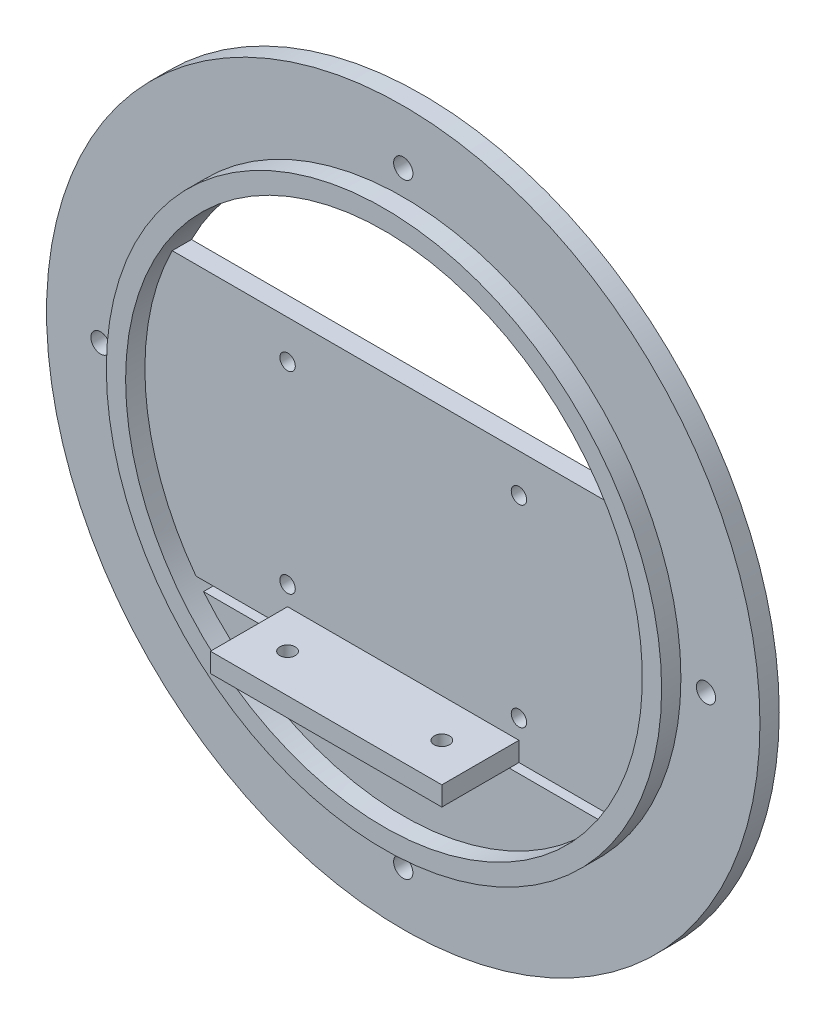
ISO-10303-21;
HEADER;
FILE_DESCRIPTION(('STEP AP214'),'2;1');
FILE_NAME('part.step','',(''),(''),'','','');
FILE_SCHEMA(('AUTOMOTIVE_DESIGN { 1 0 10303 214 1 1 1 1 }'));
ENDSEC;
DATA;
#1=APPLICATION_CONTEXT('core data for automotive mechanical design processes');
#2=APPLICATION_PROTOCOL_DEFINITION('international standard','automotive_design',2000,#1);
#3=PRODUCT_CONTEXT('',#1,'mechanical');
#4=PRODUCT('Part','Part','',(#3));
#5=PRODUCT_RELATED_PRODUCT_CATEGORY('part','',(#4));
#6=PRODUCT_DEFINITION_FORMATION('','',#4);
#7=PRODUCT_DEFINITION_CONTEXT('part definition',#1,'design');
#8=PRODUCT_DEFINITION('design','',#6,#7);
#9=PRODUCT_DEFINITION_SHAPE('','',#8);
#10=(LENGTH_UNIT() NAMED_UNIT(*) SI_UNIT(.MILLI.,.METRE.));
#11=(NAMED_UNIT(*) PLANE_ANGLE_UNIT() SI_UNIT($,.RADIAN.));
#12=(NAMED_UNIT(*) SI_UNIT($,.STERADIAN.) SOLID_ANGLE_UNIT());
#13=UNCERTAINTY_MEASURE_WITH_UNIT(LENGTH_MEASURE(1.E-05),#10,'distance_accuracy_value','');
#14=(GEOMETRIC_REPRESENTATION_CONTEXT(3) GLOBAL_UNCERTAINTY_ASSIGNED_CONTEXT((#13)) GLOBAL_UNIT_ASSIGNED_CONTEXT((#10,
#11,#12)) REPRESENTATION_CONTEXT('',''));
#15=CARTESIAN_POINT('',(0.,0.,0.));
#16=DIRECTION('',(0.,0.,1.));
#17=DIRECTION('',(1.,0.,0.));
#18=AXIS2_PLACEMENT_3D('',#15,#16,#17);
#19=CARTESIAN_POINT('',(0.,0.,0.));
#20=DIRECTION('',(0.,0.,1.));
#21=DIRECTION('',(1.,0.,0.));
#22=AXIS2_PLACEMENT_3D('',#19,#20,#21);
#23=PLANE('',#22);
#24=CARTESIAN_POINT('',(0.,-78.5,0.));
#25=DIRECTION('',(0.,0.,-1.));
#26=DIRECTION('',(-1.,0.,0.));
#27=AXIS2_PLACEMENT_3D('',#24,#25,#26);
#28=CIRCLE('',#27,2.5);
#29=CARTESIAN_POINT('',(-2.5,-78.5,0.));
#30=VERTEX_POINT('',#29);
#31=EDGE_CURVE('E373',#30,#30,#28,.T.);
#32=ORIENTED_EDGE('',*,*,#31,.F.);
#33=EDGE_LOOP('',(#32));
#34=FACE_BOUND('',#33,.T.);
#35=CARTESIAN_POINT('',(78.5,0.,0.));
#36=DIRECTION('',(0.,0.,-1.));
#37=DIRECTION('',(-1.,0.,0.));
#38=AXIS2_PLACEMENT_3D('',#35,#36,#37);
#39=CIRCLE('',#38,2.50000000000001);
#40=CARTESIAN_POINT('',(76.,0.,0.));
#41=VERTEX_POINT('',#40);
#42=EDGE_CURVE('E367',#41,#41,#39,.T.);
#43=ORIENTED_EDGE('',*,*,#42,.F.);
#44=EDGE_LOOP('',(#43));
#45=FACE_BOUND('',#44,.T.);
#46=CARTESIAN_POINT('',(0.,78.5,0.));
#47=DIRECTION('',(0.,0.,-1.));
#48=DIRECTION('',(-1.,0.,0.));
#49=AXIS2_PLACEMENT_3D('',#46,#47,#48);
#50=CIRCLE('',#49,2.5);
#51=CARTESIAN_POINT('',(-2.5,78.5,0.));
#52=VERTEX_POINT('',#51);
#53=EDGE_CURVE('E360',#52,#52,#50,.T.);
#54=ORIENTED_EDGE('',*,*,#53,.F.);
#55=EDGE_LOOP('',(#54));
#56=FACE_BOUND('',#55,.T.);
#57=CARTESIAN_POINT('',(-78.5,0.,0.));
#58=DIRECTION('',(0.,0.,-1.));
#59=DIRECTION('',(-1.,0.,0.));
#60=AXIS2_PLACEMENT_3D('',#57,#58,#59);
#61=CIRCLE('',#60,2.49999999999999);
#62=CARTESIAN_POINT('',(-81.,0.,0.));
#63=VERTEX_POINT('',#62);
#64=EDGE_CURVE('E361',#63,#63,#61,.T.);
#65=ORIENTED_EDGE('',*,*,#64,.F.);
#66=EDGE_LOOP('',(#65));
#67=FACE_BOUND('',#66,.T.);
#68=CARTESIAN_POINT('',(-30.,-30.,0.));
#69=DIRECTION('',(0.,0.,-1.));
#70=DIRECTION('',(-1.,0.,0.));
#71=AXIS2_PLACEMENT_3D('',#68,#69,#70);
#72=CIRCLE('',#71,2.);
#73=CARTESIAN_POINT('',(-32.,-30.,0.));
#74=VERTEX_POINT('',#73);
#75=EDGE_CURVE('E343',#74,#74,#72,.T.);
#76=ORIENTED_EDGE('',*,*,#75,.F.);
#77=EDGE_LOOP('',(#76));
#78=FACE_BOUND('',#77,.T.);
#79=CARTESIAN_POINT('',(-30.,20.,0.));
#80=DIRECTION('',(0.,0.,-1.));
#81=DIRECTION('',(-1.,0.,0.));
#82=AXIS2_PLACEMENT_3D('',#79,#80,#81);
#83=CIRCLE('',#82,2.);
#84=CARTESIAN_POINT('',(-32.,20.,0.));
#85=VERTEX_POINT('',#84);
#86=EDGE_CURVE('E342',#85,#85,#83,.T.);
#87=ORIENTED_EDGE('',*,*,#86,.F.);
#88=EDGE_LOOP('',(#87));
#89=FACE_BOUND('',#88,.T.);
#90=CARTESIAN_POINT('',(30.,20.,0.));
#91=DIRECTION('',(0.,0.,-1.));
#92=DIRECTION('',(-1.,0.,0.));
#93=AXIS2_PLACEMENT_3D('',#90,#91,#92);
#94=CIRCLE('',#93,2.);
#95=CARTESIAN_POINT('',(28.,20.,0.));
#96=VERTEX_POINT('',#95);
#97=EDGE_CURVE('E350',#96,#96,#94,.T.);
#98=ORIENTED_EDGE('',*,*,#97,.F.);
#99=EDGE_LOOP('',(#98));
#100=FACE_BOUND('',#99,.T.);
#101=CARTESIAN_POINT('',(30.,-30.,0.));
#102=DIRECTION('',(0.,0.,-1.));
#103=DIRECTION('',(-1.,0.,0.));
#104=AXIS2_PLACEMENT_3D('',#101,#102,#103);
#105=CIRCLE('',#104,2.);
#106=CARTESIAN_POINT('',(28.,-30.,0.));
#107=VERTEX_POINT('',#106);
#108=EDGE_CURVE('E335',#107,#107,#105,.T.);
#109=ORIENTED_EDGE('',*,*,#108,.F.);
#110=EDGE_LOOP('',(#109));
#111=FACE_BOUND('',#110,.T.);
#112=CARTESIAN_POINT('',(0.,0.,0.));
#113=DIRECTION('',(0.,0.,1.));
#114=DIRECTION('',(1.,0.,0.));
#115=AXIS2_PLACEMENT_3D('',#112,#113,#114);
#116=CIRCLE('',#115,92.5);
#117=CARTESIAN_POINT('',(92.5,0.,0.));
#118=VERTEX_POINT('',#117);
#119=EDGE_CURVE('E218',#118,#118,#116,.T.);
#120=ORIENTED_EDGE('',*,*,#119,.F.);
#121=EDGE_LOOP('',(#120));
#122=FACE_BOUND('',#121,.T.);
#123=DIRECTION('',(1.,0.,0.));
#124=VECTOR('',#123,1.);
#125=CARTESIAN_POINT('',(-70.,30.,0.));
#126=LINE('',#125,#124);
#127=CARTESIAN_POINT('',(-59.9082632030007,30.,0.));
#128=VERTEX_POINT('',#127);
#129=CARTESIAN_POINT('',(59.9082632030007,30.,0.));
#130=VERTEX_POINT('',#129);
#131=EDGE_CURVE('E198',#128,#130,#126,.T.);
#132=ORIENTED_EDGE('',*,*,#131,.T.);
#133=CARTESIAN_POINT('',(0.,0.,0.));
#134=DIRECTION('',(0.,0.,-1.));
#135=DIRECTION('',(-1.,0.,0.));
#136=AXIS2_PLACEMENT_3D('',#133,#134,#135);
#137=CIRCLE('',#136,67.);
#138=EDGE_CURVE('E213',#128,#130,#137,.T.);
#139=ORIENTED_EDGE('',*,*,#138,.F.);
#140=EDGE_LOOP('',(#132,#139));
#141=FACE_BOUND('',#140,.T.);
#142=DIRECTION('',(0.,-1.,0.));
#143=VECTOR('',#142,1.);
#144=CARTESIAN_POINT('',(30.,-42.5,0.));
#145=LINE('',#144,#143);
#146=CARTESIAN_POINT('',(30.,-42.5,0.));
#147=VERTEX_POINT('',#146);
#148=CARTESIAN_POINT('',(30.,-47.5,0.));
#149=VERTEX_POINT('',#148);
#150=EDGE_CURVE('E160',#147,#149,#145,.T.);
#151=ORIENTED_EDGE('',*,*,#150,.F.);
#152=DIRECTION('',(1.,0.,0.));
#153=VECTOR('',#152,1.);
#154=CARTESIAN_POINT('',(55.,-42.5,0.));
#155=LINE('',#154,#153);
#156=CARTESIAN_POINT('',(51.7952700543206,-42.5,0.));
#157=VERTEX_POINT('',#156);
#158=EDGE_CURVE('E161',#147,#157,#155,.T.);
#159=ORIENTED_EDGE('',*,*,#158,.T.);
#160=CARTESIAN_POINT('',(55.52251795443,-37.5,0.));
#161=VERTEX_POINT('',#160);
#162=EDGE_CURVE('E215',#161,#157,#137,.T.);
#163=ORIENTED_EDGE('',*,*,#162,.F.);
#164=DIRECTION('',(-1.,0.,0.));
#165=VECTOR('',#164,1.);
#166=CARTESIAN_POINT('',(-53.7494186015068,-37.5,0.));
#167=LINE('',#166,#165);
#168=CARTESIAN_POINT('',(-55.52251795443,-37.5,0.));
#169=VERTEX_POINT('',#168);
#170=EDGE_CURVE('E240',#161,#169,#167,.T.);
#171=ORIENTED_EDGE('',*,*,#170,.T.);
#172=CARTESIAN_POINT('',(-51.7952700543206,-42.5,0.));
#173=VERTEX_POINT('',#172);
#174=EDGE_CURVE('E206',#173,#169,#137,.T.);
#175=ORIENTED_EDGE('',*,*,#174,.F.);
#176=CARTESIAN_POINT('',(-30.,-42.5,0.));
#177=VERTEX_POINT('',#176);
#178=EDGE_CURVE('E163',#173,#177,#155,.T.);
#179=ORIENTED_EDGE('',*,*,#178,.T.);
#180=DIRECTION('',(0.,1.,0.));
#181=VECTOR('',#180,1.);
#182=CARTESIAN_POINT('',(-30.,-42.5,0.));
#183=LINE('',#182,#181);
#184=CARTESIAN_POINT('',(-30.,-47.5,0.));
#185=VERTEX_POINT('',#184);
#186=EDGE_CURVE('E54',#185,#177,#183,.T.);
#187=ORIENTED_EDGE('',*,*,#186,.F.);
#188=DIRECTION('',(-1.,0.,0.));
#189=VECTOR('',#188,1.);
#190=CARTESIAN_POINT('',(30.,-47.5,0.));
#191=LINE('',#190,#189);
#192=EDGE_CURVE('E49',#149,#185,#191,.T.);
#193=ORIENTED_EDGE('',*,*,#192,.F.);
#194=EDGE_LOOP('',(#151,#159,#163,#171,#175,#179,#187,#193));
#195=FACE_BOUND('',#194,.T.);
#196=ADVANCED_FACE('F33',(#34,#45,#56,#67,#78,#89,#100,#111,#122,#141,#195),#23,.F.);
#197=CARTESIAN_POINT('',(0.,0.,5.));
#198=DIRECTION('',(0.,0.,1.));
#199=DIRECTION('',(1.,0.,0.));
#200=AXIS2_PLACEMENT_3D('',#197,#198,#199);
#201=PLANE('',#200);
#202=CARTESIAN_POINT('',(-30.,-30.,5.));
#203=DIRECTION('',(0.,0.,1.));
#204=DIRECTION('',(1.,0.,0.));
#205=AXIS2_PLACEMENT_3D('',#202,#203,#204);
#206=CIRCLE('',#205,2.);
#207=CARTESIAN_POINT('',(-28.,-30.,5.));
#208=VERTEX_POINT('',#207);
#209=EDGE_CURVE('E339',#208,#208,#206,.F.);
#210=ORIENTED_EDGE('',*,*,#209,.T.);
#211=EDGE_LOOP('',(#210));
#212=FACE_BOUND('',#211,.T.);
#213=CARTESIAN_POINT('',(-30.,20.,5.));
#214=DIRECTION('',(0.,0.,1.));
#215=DIRECTION('',(1.,0.,0.));
#216=AXIS2_PLACEMENT_3D('',#213,#214,#215);
#217=CIRCLE('',#216,2.);
#218=CARTESIAN_POINT('',(-28.,20.,5.));
#219=VERTEX_POINT('',#218);
#220=EDGE_CURVE('E347',#219,#219,#217,.F.);
#221=ORIENTED_EDGE('',*,*,#220,.T.);
#222=EDGE_LOOP('',(#221));
#223=FACE_BOUND('',#222,.T.);
#224=CARTESIAN_POINT('',(30.,20.,5.));
#225=DIRECTION('',(0.,0.,1.));
#226=DIRECTION('',(1.,0.,0.));
#227=AXIS2_PLACEMENT_3D('',#224,#225,#226);
#228=CIRCLE('',#227,2.);
#229=CARTESIAN_POINT('',(32.,20.,5.));
#230=VERTEX_POINT('',#229);
#231=EDGE_CURVE('E338',#230,#230,#228,.F.);
#232=ORIENTED_EDGE('',*,*,#231,.T.);
#233=EDGE_LOOP('',(#232));
#234=FACE_BOUND('',#233,.T.);
#235=CARTESIAN_POINT('',(30.,-30.,5.));
#236=DIRECTION('',(0.,0.,1.));
#237=DIRECTION('',(1.,0.,0.));
#238=AXIS2_PLACEMENT_3D('',#235,#236,#237);
#239=CIRCLE('',#238,2.);
#240=CARTESIAN_POINT('',(32.,-30.,5.));
#241=VERTEX_POINT('',#240);
#242=EDGE_CURVE('E328',#241,#241,#239,.F.);
#243=ORIENTED_EDGE('',*,*,#242,.T.);
#244=EDGE_LOOP('',(#243));
#245=FACE_BOUND('',#244,.T.);
#246=DIRECTION('',(-1.,0.,0.));
#247=VECTOR('',#246,1.);
#248=CARTESIAN_POINT('',(30.,-35.,5.));
#249=LINE('',#248,#247);
#250=CARTESIAN_POINT('',(30.,-35.,5.));
#251=VERTEX_POINT('',#250);
#252=CARTESIAN_POINT('',(-30.,-35.,5.));
#253=VERTEX_POINT('',#252);
#254=EDGE_CURVE('E186',#251,#253,#249,.T.);
#255=ORIENTED_EDGE('',*,*,#254,.F.);
#256=DIRECTION('',(0.,1.,0.));
#257=VECTOR('',#256,1.);
#258=CARTESIAN_POINT('',(30.,-40.,5.));
#259=LINE('',#258,#257);
#260=CARTESIAN_POINT('',(30.,-40.,5.));
#261=VERTEX_POINT('',#260);
#262=EDGE_CURVE('E171',#261,#251,#259,.T.);
#263=ORIENTED_EDGE('',*,*,#262,.F.);
#264=DIRECTION('',(-1.,0.,0.));
#265=VECTOR('',#264,1.);
#266=CARTESIAN_POINT('',(-70.,-40.,5.));
#267=LINE('',#266,#265);
#268=CARTESIAN_POINT('',(53.7494186015067,-40.,5.));
#269=VERTEX_POINT('',#268);
#270=EDGE_CURVE('E203',#269,#261,#267,.T.);
#271=ORIENTED_EDGE('',*,*,#270,.F.);
#272=CARTESIAN_POINT('',(0.,0.,5.));
#273=DIRECTION('',(0.,0.,1.));
#274=DIRECTION('',(1.,0.,0.));
#275=AXIS2_PLACEMENT_3D('',#272,#273,#274);
#276=CIRCLE('',#275,67.);
#277=CARTESIAN_POINT('',(59.9082632030007,30.,5.));
#278=VERTEX_POINT('',#277);
#279=EDGE_CURVE('E222',#278,#269,#276,.F.);
#280=ORIENTED_EDGE('',*,*,#279,.F.);
#281=DIRECTION('',(1.,0.,0.));
#282=VECTOR('',#281,1.);
#283=CARTESIAN_POINT('',(-70.,30.,5.));
#284=LINE('',#283,#282);
#285=CARTESIAN_POINT('',(-59.9082632030007,30.,5.));
#286=VERTEX_POINT('',#285);
#287=EDGE_CURVE('E199',#286,#278,#284,.T.);
#288=ORIENTED_EDGE('',*,*,#287,.F.);
#289=CARTESIAN_POINT('',(-53.7494186015068,-40.,5.));
#290=VERTEX_POINT('',#289);
#291=EDGE_CURVE('E230',#290,#286,#276,.F.);
#292=ORIENTED_EDGE('',*,*,#291,.F.);
#293=CARTESIAN_POINT('',(-30.,-40.,5.));
#294=VERTEX_POINT('',#293);
#295=EDGE_CURVE('E202',#294,#290,#267,.T.);
#296=ORIENTED_EDGE('',*,*,#295,.F.);
#297=DIRECTION('',(0.,-1.,0.));
#298=VECTOR('',#297,1.);
#299=CARTESIAN_POINT('',(-30.,-40.,5.));
#300=LINE('',#299,#298);
#301=EDGE_CURVE('E177',#253,#294,#300,.T.);
#302=ORIENTED_EDGE('',*,*,#301,.F.);
#303=EDGE_LOOP('',(#255,#263,#271,#280,#288,#292,#296,#302));
#304=FACE_BOUND('',#303,.T.);
#305=ADVANCED_FACE('F282',(#212,#223,#234,#245,#304),#201,.T.);
#306=CARTESIAN_POINT('',(0.,0.,5.));
#307=DIRECTION('',(0.,0.,-1.));
#308=DIRECTION('',(-1.,0.,0.));
#309=AXIS2_PLACEMENT_3D('',#306,#307,#308);
#310=CYLINDRICAL_SURFACE('',#309,92.5);
#311=CARTESIAN_POINT('',(0.,0.,5.));
#312=DIRECTION('',(0.,0.,1.));
#313=DIRECTION('',(1.,0.,0.));
#314=AXIS2_PLACEMENT_3D('',#311,#312,#313);
#315=CIRCLE('',#314,92.5);
#316=CARTESIAN_POINT('',(92.5,0.,5.));
#317=VERTEX_POINT('',#316);
#318=EDGE_CURVE('E223',#317,#317,#315,.T.);
#319=ORIENTED_EDGE('',*,*,#318,.F.);
#320=EDGE_LOOP('',(#319));
#321=FACE_BOUND('',#320,.T.);
#322=ORIENTED_EDGE('',*,*,#119,.T.);
#323=EDGE_LOOP('',(#322));
#324=FACE_BOUND('',#323,.T.);
#325=ADVANCED_FACE('F279',(#321,#324),#310,.T.);
#326=CARTESIAN_POINT('',(0.,0.,5.));
#327=DIRECTION('',(0.,0.,1.));
#328=DIRECTION('',(1.,0.,0.));
#329=AXIS2_PLACEMENT_3D('',#326,#327,#328);
#330=PLANE('',#329);
#331=CARTESIAN_POINT('',(0.,-78.5,5.));
#332=DIRECTION('',(0.,0.,1.));
#333=DIRECTION('',(1.,0.,0.));
#334=AXIS2_PLACEMENT_3D('',#331,#332,#333);
#335=CIRCLE('',#334,2.5);
#336=CARTESIAN_POINT('',(2.5,-78.5,5.));
#337=VERTEX_POINT('',#336);
#338=EDGE_CURVE('E346',#337,#337,#335,.F.);
#339=ORIENTED_EDGE('',*,*,#338,.T.);
#340=EDGE_LOOP('',(#339));
#341=FACE_BOUND('',#340,.T.);
#342=CARTESIAN_POINT('',(78.5,0.,5.));
#343=DIRECTION('',(0.,0.,1.));
#344=DIRECTION('',(1.,0.,0.));
#345=AXIS2_PLACEMENT_3D('',#342,#343,#344);
#346=CIRCLE('',#345,2.50000000000001);
#347=CARTESIAN_POINT('',(81.,0.,5.));
#348=VERTEX_POINT('',#347);
#349=EDGE_CURVE('E370',#348,#348,#346,.F.);
#350=ORIENTED_EDGE('',*,*,#349,.T.);
#351=EDGE_LOOP('',(#350));
#352=FACE_BOUND('',#351,.T.);
#353=CARTESIAN_POINT('',(0.,78.5,5.));
#354=DIRECTION('',(0.,0.,1.));
#355=DIRECTION('',(1.,0.,0.));
#356=AXIS2_PLACEMENT_3D('',#353,#354,#355);
#357=CIRCLE('',#356,2.5);
#358=CARTESIAN_POINT('',(2.5,78.5,5.));
#359=VERTEX_POINT('',#358);
#360=EDGE_CURVE('E364',#359,#359,#357,.F.);
#361=ORIENTED_EDGE('',*,*,#360,.T.);
#362=EDGE_LOOP('',(#361));
#363=FACE_BOUND('',#362,.T.);
#364=CARTESIAN_POINT('',(-78.5,0.,5.));
#365=DIRECTION('',(0.,0.,1.));
#366=DIRECTION('',(1.,0.,0.));
#367=AXIS2_PLACEMENT_3D('',#364,#365,#366);
#368=CIRCLE('',#367,2.49999999999999);
#369=CARTESIAN_POINT('',(-76.,0.,5.));
#370=VERTEX_POINT('',#369);
#371=EDGE_CURVE('E357',#370,#370,#368,.F.);
#372=ORIENTED_EDGE('',*,*,#371,.T.);
#373=EDGE_LOOP('',(#372));
#374=FACE_BOUND('',#373,.T.);
#375=CARTESIAN_POINT('',(0.,0.,5.));
#376=DIRECTION('',(0.,0.,1.));
#377=DIRECTION('',(1.,0.,0.));
#378=AXIS2_PLACEMENT_3D('',#375,#376,#377);
#379=CIRCLE('',#378,72.);
#380=CARTESIAN_POINT('',(72.,0.,5.));
#381=VERTEX_POINT('',#380);
#382=EDGE_CURVE('E219',#381,#381,#379,.T.);
#383=ORIENTED_EDGE('',*,*,#382,.F.);
#384=EDGE_LOOP('',(#383));
#385=FACE_BOUND('',#384,.T.);
#386=ORIENTED_EDGE('',*,*,#318,.T.);
#387=EDGE_LOOP('',(#386));
#388=FACE_BOUND('',#387,.T.);
#389=ADVANCED_FACE('F275',(#341,#352,#363,#374,#385,#388),#330,.T.);
#390=CARTESIAN_POINT('',(0.,0.,10.));
#391=DIRECTION('',(0.,0.,-1.));
#392=DIRECTION('',(-1.,0.,0.));
#393=AXIS2_PLACEMENT_3D('',#390,#391,#392);
#394=CYLINDRICAL_SURFACE('',#393,72.);
#395=CARTESIAN_POINT('',(0.,0.,10.));
#396=DIRECTION('',(0.,0.,1.));
#397=DIRECTION('',(1.,0.,0.));
#398=AXIS2_PLACEMENT_3D('',#395,#396,#397);
#399=CIRCLE('',#398,72.);
#400=CARTESIAN_POINT('',(72.,0.,10.));
#401=VERTEX_POINT('',#400);
#402=EDGE_CURVE('E212',#401,#401,#399,.T.);
#403=ORIENTED_EDGE('',*,*,#402,.F.);
#404=EDGE_LOOP('',(#403));
#405=FACE_BOUND('',#404,.T.);
#406=ORIENTED_EDGE('',*,*,#382,.T.);
#407=EDGE_LOOP('',(#406));
#408=FACE_BOUND('',#407,.T.);
#409=ADVANCED_FACE('F271',(#405,#408),#394,.T.);
#410=CARTESIAN_POINT('',(0.,0.,10.));
#411=DIRECTION('',(0.,0.,1.));
#412=DIRECTION('',(1.,0.,0.));
#413=AXIS2_PLACEMENT_3D('',#410,#411,#412);
#414=PLANE('',#413);
#415=CARTESIAN_POINT('',(0.,0.,10.));
#416=DIRECTION('',(0.,0.,-1.));
#417=DIRECTION('',(-1.,0.,0.));
#418=AXIS2_PLACEMENT_3D('',#415,#416,#417);
#419=CIRCLE('',#418,67.);
#420=CARTESIAN_POINT('',(-67.,0.,10.));
#421=VERTEX_POINT('',#420);
#422=EDGE_CURVE('E209',#421,#421,#419,.T.);
#423=ORIENTED_EDGE('',*,*,#422,.T.);
#424=EDGE_LOOP('',(#423));
#425=FACE_BOUND('',#424,.T.);
#426=ORIENTED_EDGE('',*,*,#402,.T.);
#427=EDGE_LOOP('',(#426));
#428=FACE_BOUND('',#427,.T.);
#429=ADVANCED_FACE('F264',(#425,#428),#414,.T.);
#430=CARTESIAN_POINT('',(0.,0.,10.));
#431=DIRECTION('',(0.,0.,-1.));
#432=DIRECTION('',(-1.,0.,0.));
#433=AXIS2_PLACEMENT_3D('',#430,#431,#432);
#434=CYLINDRICAL_SURFACE('',#433,67.);
#435=ORIENTED_EDGE('',*,*,#162,.T.);
#436=DIRECTION('',(0.,0.,-1.));
#437=VECTOR('',#436,1.);
#438=CARTESIAN_POINT('',(51.7952700543206,-42.5,10.));
#439=LINE('',#438,#437);
#440=CARTESIAN_POINT('',(51.7952700543206,-42.5,5.));
#441=VERTEX_POINT('',#440);
#442=EDGE_CURVE('E11',#157,#441,#439,.F.);
#443=ORIENTED_EDGE('',*,*,#442,.T.);
#444=CARTESIAN_POINT('',(0.,0.,5.));
#445=DIRECTION('',(0.,0.,-1.));
#446=DIRECTION('',(-1.,0.,0.));
#447=AXIS2_PLACEMENT_3D('',#444,#445,#446);
#448=CIRCLE('',#447,67.);
#449=CARTESIAN_POINT('',(-51.7952700543206,-42.5,5.));
#450=VERTEX_POINT('',#449);
#451=EDGE_CURVE('E444',#450,#441,#448,.F.);
#452=ORIENTED_EDGE('',*,*,#451,.F.);
#453=DIRECTION('',(0.,0.,-1.));
#454=VECTOR('',#453,1.);
#455=CARTESIAN_POINT('',(-51.7952700543206,-42.5,10.));
#456=LINE('',#455,#454);
#457=EDGE_CURVE('E42',#450,#173,#456,.T.);
#458=ORIENTED_EDGE('',*,*,#457,.T.);
#459=ORIENTED_EDGE('',*,*,#174,.T.);
#460=CARTESIAN_POINT('',(-55.52251795443,-37.5,0.));
#461=CARTESIAN_POINT('',(-55.4632440830582,-37.58776320925,1.588865583409E-05));
#462=CARTESIAN_POINT('',(-55.4037949976396,-37.6753318881441,0.00462328313600626));
#463=CARTESIAN_POINT('',(-55.2849136580255,-37.8495631871308,0.0230045283893117));
#464=CARTESIAN_POINT('',(-55.2254814194392,-37.9362254404987,0.0367819537786903));
#465=CARTESIAN_POINT('',(-55.046934102485,-38.1952750780284,0.0921170171802291));
#466=CARTESIAN_POINT('',(-54.9284785371727,-38.3653785083892,0.147677694833614));
#467=CARTESIAN_POINT('',(-54.7032524907535,-38.6857968416439,0.292416472417243));
#468=CARTESIAN_POINT('',(-54.5961953250302,-38.836661167315,0.379939047007094));
#469=CARTESIAN_POINT('',(-54.3928966144718,-39.120877531332,0.588564159533133));
#470=CARTESIAN_POINT('',(-54.2966099752949,-39.2543030116989,0.709518717677333));
#471=CARTESIAN_POINT('',(-54.1489938820084,-39.4575332552187,0.940009284231443));
#472=CARTESIAN_POINT('',(-54.0931390834981,-39.5340323071798,1.04080871983558));
#473=CARTESIAN_POINT('',(-53.9915237891939,-39.6726950065866,1.25670255587298));
#474=CARTESIAN_POINT('',(-53.945763710393,-39.7348580618454,1.37179754652063));
#475=CARTESIAN_POINT('',(-53.8865916762624,-39.8150268539274,1.55388687777492));
#476=CARTESIAN_POINT('',(-53.868377872019,-39.8396614985135,1.61649950453075));
#477=CARTESIAN_POINT('',(-53.8355445416251,-39.884018150131,1.74433894499644));
#478=CARTESIAN_POINT('',(-53.820922982202,-39.9037429363109,1.80956425545199));
#479=CARTESIAN_POINT('',(-53.7955927243815,-39.9378849727522,1.94198102060025));
#480=CARTESIAN_POINT('',(-53.7848760407399,-39.9523130549253,2.00916815590287));
#481=CARTESIAN_POINT('',(-53.7675543069141,-39.9756215256442,2.14498269715764));
#482=CARTESIAN_POINT('',(-53.7609459955989,-39.9845063143483,2.21360891594969));
#483=CARTESIAN_POINT('',(-53.7541193844086,-39.9936827884614,2.31871838562667));
#484=CARTESIAN_POINT('',(-53.7523566780077,-39.9960517736335,2.35493673306331));
#485=CARTESIAN_POINT('',(-53.7500067049264,-39.9992097558051,2.4274345606377));
#486=CARTESIAN_POINT('',(-53.749417963693,-40.0000007348516,2.46371390672953));
#487=CARTESIAN_POINT('',(-53.7494186015068,-40.,2.5));
#488=B_SPLINE_CURVE_WITH_KNOTS('',3,(#460,#461,#462,#463,#464,#465,#466,#467,#468,#469,#470,
#471,#472,#473,#474,#475,#476,#477,#478,#479,#480,#481,#482,#483,#484,#485,#486,#487),
.UNSPECIFIED.,.F.,.F.,(4,2,2,2,2,2,2,2,2,2,2,2,2,4),(0.,0.317488136792001,0.635100107785104,
1.27513520139012,1.8858682446488,2.49394013888756,2.90738515469495,3.32084724590526,
3.52970599118443,3.73844624502665,3.94675720920705,4.15490260912474,4.26387116804923,
4.37270277114536),.UNSPECIFIED.);
#489=CARTESIAN_POINT('',(-53.7494186015068,-40.,2.5));
#490=VERTEX_POINT('',#489);
#491=EDGE_CURVE('E245',#169,#490,#488,.T.);
#492=ORIENTED_EDGE('',*,*,#491,.T.);
#493=DIRECTION('',(0.,0.,-1.));
#494=VECTOR('',#493,1.);
#495=CARTESIAN_POINT('',(-53.7494186015068,-40.,10.));
#496=LINE('',#495,#494);
#497=EDGE_CURVE('E238',#490,#290,#496,.F.);
#498=ORIENTED_EDGE('',*,*,#497,.T.);
#499=ORIENTED_EDGE('',*,*,#291,.T.);
#500=DIRECTION('',(0.,0.,-1.));
#501=VECTOR('',#500,1.);
#502=CARTESIAN_POINT('',(-59.9082632030007,30.,10.));
#503=LINE('',#502,#501);
#504=EDGE_CURVE('E235',#286,#128,#503,.T.);
#505=ORIENTED_EDGE('',*,*,#504,.T.);
#506=ORIENTED_EDGE('',*,*,#138,.T.);
#507=DIRECTION('',(0.,0.,-1.));
#508=VECTOR('',#507,1.);
#509=CARTESIAN_POINT('',(59.9082632030007,30.,10.));
#510=LINE('',#509,#508);
#511=EDGE_CURVE('E229',#130,#278,#510,.F.);
#512=ORIENTED_EDGE('',*,*,#511,.T.);
#513=ORIENTED_EDGE('',*,*,#279,.T.);
#514=DIRECTION('',(0.,0.,-1.));
#515=VECTOR('',#514,1.);
#516=CARTESIAN_POINT('',(53.7494186015067,-40.,10.));
#517=LINE('',#516,#515);
#518=CARTESIAN_POINT('',(53.7494186015067,-40.,2.5));
#519=VERTEX_POINT('',#518);
#520=EDGE_CURVE('E232',#269,#519,#517,.T.);
#521=ORIENTED_EDGE('',*,*,#520,.T.);
#522=CARTESIAN_POINT('',(53.7494186015067,-40.,2.5));
#523=CARTESIAN_POINT('',(53.7494085114287,-40.0000123908809,2.43930959965619));
#524=CARTESIAN_POINT('',(53.7510629600194,-39.9977903909757,2.37862744942735));
#525=CARTESIAN_POINT('',(53.7576237294607,-39.9889728034297,2.25778918899682));
#526=CARTESIAN_POINT('',(53.762528370558,-39.982379474963,2.19763282332367));
#527=CARTESIAN_POINT('',(53.7754736405455,-39.9649664693916,2.07864886097415));
#528=CARTESIAN_POINT('',(53.7834953392095,-39.954172303825,2.01981546916449));
#529=CARTESIAN_POINT('',(53.8025300025628,-39.9285364081723,1.90354362752521));
#530=CARTESIAN_POINT('',(53.8135432126914,-39.913694345975,1.84610529257481));
#531=CARTESIAN_POINT('',(53.8507770190097,-39.8634614902711,1.6766690494055));
#532=CARTESIAN_POINT('',(53.8812276549487,-39.8223159837194,1.56723154797739));
#533=CARTESIAN_POINT('',(53.9517399480183,-39.7267323945261,1.35763978467214));
#534=CARTESIAN_POINT('',(53.9918147643792,-39.6722761101049,1.25749849581147));
#535=CARTESIAN_POINT('',(54.0830591523657,-39.5478075543817,1.06090463101593));
#536=CARTESIAN_POINT('',(54.1348307662797,-39.4769416456489,0.965275116577705));
#537=CARTESIAN_POINT('',(54.2453732440932,-39.3249071822827,0.787272728104595));
#538=CARTESIAN_POINT('',(54.304145682763,-39.2437363093727,0.704902846535596));
#539=CARTESIAN_POINT('',(54.4386421079447,-39.0570075463906,0.539360695898549));
#540=CARTESIAN_POINT('',(54.5154659174583,-38.9497455350817,0.459005475765163));
#541=CARTESIAN_POINT('',(54.6742375914399,-38.7265613270561,0.317562077150722));
#542=CARTESIAN_POINT('',(54.7561914205947,-38.610629017688,0.256496845153551));
#543=CARTESIAN_POINT('',(54.9386074182777,-38.3507366819709,0.144197336630406));
#544=CARTESIAN_POINT('',(55.03970110147,-38.2055437949092,0.0968376912570801));
#545=CARTESIAN_POINT('',(55.2434429881226,-37.910342391821,0.0292728829770364));
#546=CARTESIAN_POINT('',(55.3460883441206,-37.7603422372724,0.0090229400905055));
#547=CARTESIAN_POINT('',(55.4730660388496,-37.5731412380005,0.000802618745671298));
#548=CARTESIAN_POINT('',(55.4978142386588,-37.5365773624677,-1.45496067119308E-07));
#549=CARTESIAN_POINT('',(55.52251795443,-37.5,0.));
#550=B_SPLINE_CURVE_WITH_KNOTS('',3,(#522,#523,#524,#525,#526,#527,#528,#529,#530,#531,#532,
#533,#534,#535,#536,#537,#538,#539,#540,#541,#542,#543,#544,#545,#546,#547,#548,#549),
.UNSPECIFIED.,.F.,.F.,(4,2,2,2,2,2,2,2,2,2,2,2,2,4),(0.,0.181994419737893,0.363894855029514,
0.544707433052058,0.725534850370069,1.08623042832009,1.44742202504253,1.83537540596981,
2.22341621877373,2.68513323558594,3.14739743933252,3.69469408200092,4.24108557653509,
4.37353100076493),.UNSPECIFIED.);
#551=EDGE_CURVE('E252',#519,#161,#550,.T.);
#552=ORIENTED_EDGE('',*,*,#551,.T.);
#553=EDGE_LOOP('',(#435,#443,#452,#458,#459,#492,#498,#499,#505,#506,#512,#513,#521,#552));
#554=FACE_BOUND('',#553,.T.);
#555=ORIENTED_EDGE('',*,*,#422,.F.);
#556=EDGE_LOOP('',(#555));
#557=FACE_BOUND('',#556,.T.);
#558=ADVANCED_FACE('F258',(#554,#557),#434,.F.);
#559=CARTESIAN_POINT('',(-70.,-40.,5.));
#560=DIRECTION('',(0.,-1.,0.));
#561=DIRECTION('',(1.,0.,0.));
#562=AXIS2_PLACEMENT_3D('',#559,#560,#561);
#563=PLANE('',#562);
#564=CARTESIAN_POINT('',(-20.,-40.,15.));
#565=DIRECTION('',(0.,-1.,0.));
#566=DIRECTION('',(1.,0.,0.));
#567=AXIS2_PLACEMENT_3D('',#564,#565,#566);
#568=CIRCLE('',#567,2.);
#569=CARTESIAN_POINT('',(-18.,-40.,15.));
#570=VERTEX_POINT('',#569);
#571=EDGE_CURVE('E298',#570,#570,#568,.F.);
#572=ORIENTED_EDGE('',*,*,#571,.T.);
#573=EDGE_LOOP('',(#572));
#574=FACE_BOUND('',#573,.T.);
#575=CARTESIAN_POINT('',(20.,-40.,15.));
#576=DIRECTION('',(0.,-1.,0.));
#577=DIRECTION('',(1.,0.,0.));
#578=AXIS2_PLACEMENT_3D('',#575,#576,#577);
#579=CIRCLE('',#578,2.);
#580=CARTESIAN_POINT('',(22.,-40.,15.));
#581=VERTEX_POINT('',#580);
#582=EDGE_CURVE('E309',#581,#581,#579,.F.);
#583=ORIENTED_EDGE('',*,*,#582,.T.);
#584=EDGE_LOOP('',(#583));
#585=FACE_BOUND('',#584,.T.);
#586=ORIENTED_EDGE('',*,*,#497,.F.);
#587=DIRECTION('',(-1.,0.,0.));
#588=VECTOR('',#587,1.);
#589=CARTESIAN_POINT('',(53.7494186015067,-40.,2.5));
#590=LINE('',#589,#588);
#591=EDGE_CURVE('E243',#490,#519,#590,.F.);
#592=ORIENTED_EDGE('',*,*,#591,.T.);
#593=ORIENTED_EDGE('',*,*,#520,.F.);
#594=ORIENTED_EDGE('',*,*,#270,.T.);
#595=DIRECTION('',(0.,0.,-1.));
#596=VECTOR('',#595,1.);
#597=CARTESIAN_POINT('',(30.,-40.,25.));
#598=LINE('',#597,#596);
#599=CARTESIAN_POINT('',(30.,-40.,25.));
#600=VERTEX_POINT('',#599);
#601=EDGE_CURVE('E183',#600,#261,#598,.T.);
#602=ORIENTED_EDGE('',*,*,#601,.F.);
#603=DIRECTION('',(1.,0.,0.));
#604=VECTOR('',#603,1.);
#605=CARTESIAN_POINT('',(30.,-40.,25.));
#606=LINE('',#605,#604);
#607=CARTESIAN_POINT('',(-30.,-40.,25.));
#608=VERTEX_POINT('',#607);
#609=EDGE_CURVE('E181',#608,#600,#606,.T.);
#610=ORIENTED_EDGE('',*,*,#609,.F.);
#611=DIRECTION('',(0.,0.,-1.));
#612=VECTOR('',#611,1.);
#613=CARTESIAN_POINT('',(-30.,-40.,25.));
#614=LINE('',#613,#612);
#615=EDGE_CURVE('E191',#608,#294,#614,.T.);
#616=ORIENTED_EDGE('',*,*,#615,.T.);
#617=ORIENTED_EDGE('',*,*,#295,.T.);
#618=EDGE_LOOP('',(#586,#592,#593,#594,#602,#610,#616,#617));
#619=FACE_BOUND('',#618,.T.);
#620=ADVANCED_FACE('F263',(#574,#585,#619),#563,.T.);
#621=CARTESIAN_POINT('',(-70.,30.,5.));
#622=DIRECTION('',(0.,1.,0.));
#623=DIRECTION('',(-1.,0.,0.));
#624=AXIS2_PLACEMENT_3D('',#621,#622,#623);
#625=PLANE('',#624);
#626=ORIENTED_EDGE('',*,*,#511,.F.);
#627=ORIENTED_EDGE('',*,*,#131,.F.);
#628=ORIENTED_EDGE('',*,*,#504,.F.);
#629=ORIENTED_EDGE('',*,*,#287,.T.);
#630=EDGE_LOOP('',(#626,#627,#628,#629));
#631=FACE_BOUND('',#630,.T.);
#632=ADVANCED_FACE('F266',(#631),#625,.T.);
#633=CARTESIAN_POINT('',(30.,-40.,25.));
#634=DIRECTION('',(-1.,0.,0.));
#635=DIRECTION('',(0.,0.,1.));
#636=AXIS2_PLACEMENT_3D('',#633,#634,#635);
#637=PLANE('',#636);
#638=ORIENTED_EDGE('',*,*,#262,.T.);
#639=DIRECTION('',(0.,0.,-1.));
#640=VECTOR('',#639,1.);
#641=CARTESIAN_POINT('',(30.,-35.,25.));
#642=LINE('',#641,#640);
#643=CARTESIAN_POINT('',(30.,-35.,25.));
#644=VERTEX_POINT('',#643);
#645=EDGE_CURVE('E196',#644,#251,#642,.T.);
#646=ORIENTED_EDGE('',*,*,#645,.F.);
#647=DIRECTION('',(0.,1.,0.));
#648=VECTOR('',#647,1.);
#649=CARTESIAN_POINT('',(30.,-40.,25.));
#650=LINE('',#649,#648);
#651=EDGE_CURVE('E173',#600,#644,#650,.T.);
#652=ORIENTED_EDGE('',*,*,#651,.F.);
#653=ORIENTED_EDGE('',*,*,#601,.T.);
#654=EDGE_LOOP('',(#638,#646,#652,#653));
#655=FACE_BOUND('',#654,.T.);
#656=ADVANCED_FACE('F426',(#655),#637,.F.);
#657=CARTESIAN_POINT('',(30.,-35.,25.));
#658=DIRECTION('',(0.,-1.,0.));
#659=DIRECTION('',(1.,0.,0.));
#660=AXIS2_PLACEMENT_3D('',#657,#658,#659);
#661=PLANE('',#660);
#662=CARTESIAN_POINT('',(-20.,-35.,15.));
#663=DIRECTION('',(0.,1.,0.));
#664=DIRECTION('',(-1.,0.,0.));
#665=AXIS2_PLACEMENT_3D('',#662,#663,#664);
#666=CIRCLE('',#665,2.);
#667=CARTESIAN_POINT('',(-22.,-35.,15.));
#668=VERTEX_POINT('',#667);
#669=EDGE_CURVE('E312',#668,#668,#666,.T.);
#670=ORIENTED_EDGE('',*,*,#669,.F.);
#671=EDGE_LOOP('',(#670));
#672=FACE_BOUND('',#671,.T.);
#673=CARTESIAN_POINT('',(20.,-35.,15.));
#674=DIRECTION('',(0.,1.,0.));
#675=DIRECTION('',(-1.,0.,0.));
#676=AXIS2_PLACEMENT_3D('',#673,#674,#675);
#677=CIRCLE('',#676,2.);
#678=CARTESIAN_POINT('',(18.,-35.,15.));
#679=VERTEX_POINT('',#678);
#680=EDGE_CURVE('E313',#679,#679,#677,.T.);
#681=ORIENTED_EDGE('',*,*,#680,.F.);
#682=EDGE_LOOP('',(#681));
#683=FACE_BOUND('',#682,.T.);
#684=ORIENTED_EDGE('',*,*,#254,.T.);
#685=DIRECTION('',(0.,0.,-1.));
#686=VECTOR('',#685,1.);
#687=CARTESIAN_POINT('',(-30.,-35.,25.));
#688=LINE('',#687,#686);
#689=CARTESIAN_POINT('',(-30.,-35.,25.));
#690=VERTEX_POINT('',#689);
#691=EDGE_CURVE('E193',#690,#253,#688,.T.);
#692=ORIENTED_EDGE('',*,*,#691,.F.);
#693=DIRECTION('',(-1.,0.,0.));
#694=VECTOR('',#693,1.);
#695=CARTESIAN_POINT('',(30.,-35.,25.));
#696=LINE('',#695,#694);
#697=EDGE_CURVE('E176',#644,#690,#696,.T.);
#698=ORIENTED_EDGE('',*,*,#697,.F.);
#699=ORIENTED_EDGE('',*,*,#645,.T.);
#700=EDGE_LOOP('',(#684,#692,#698,#699));
#701=FACE_BOUND('',#700,.T.);
#702=ADVANCED_FACE('F414',(#672,#683,#701),#661,.F.);
#703=CARTESIAN_POINT('',(-30.,-40.,25.));
#704=DIRECTION('',(1.,0.,0.));
#705=DIRECTION('',(0.,1.,0.));
#706=AXIS2_PLACEMENT_3D('',#703,#704,#705);
#707=PLANE('',#706);
#708=ORIENTED_EDGE('',*,*,#301,.T.);
#709=ORIENTED_EDGE('',*,*,#615,.F.);
#710=DIRECTION('',(0.,-1.,0.));
#711=VECTOR('',#710,1.);
#712=CARTESIAN_POINT('',(-30.,-40.,25.));
#713=LINE('',#712,#711);
#714=EDGE_CURVE('E179',#690,#608,#713,.T.);
#715=ORIENTED_EDGE('',*,*,#714,.F.);
#716=ORIENTED_EDGE('',*,*,#691,.T.);
#717=EDGE_LOOP('',(#708,#709,#715,#716));
#718=FACE_BOUND('',#717,.T.);
#719=ADVANCED_FACE('F418',(#718),#707,.F.);
#720=CARTESIAN_POINT('',(0.,0.,25.));
#721=DIRECTION('',(0.,0.,1.));
#722=DIRECTION('',(1.,0.,0.));
#723=AXIS2_PLACEMENT_3D('',#720,#721,#722);
#724=PLANE('',#723);
#725=ORIENTED_EDGE('',*,*,#651,.T.);
#726=ORIENTED_EDGE('',*,*,#697,.T.);
#727=ORIENTED_EDGE('',*,*,#714,.T.);
#728=ORIENTED_EDGE('',*,*,#609,.T.);
#729=EDGE_LOOP('',(#725,#726,#727,#728));
#730=FACE_BOUND('',#729,.T.);
#731=ADVANCED_FACE('F422',(#730),#724,.T.);
#732=CARTESIAN_POINT('',(0.,-37.5,2.5));
#733=DIRECTION('',(1.,0.,0.));
#734=DIRECTION('',(0.,1.,0.));
#735=AXIS2_PLACEMENT_3D('',#732,#733,#734);
#736=CYLINDRICAL_SURFACE('',#735,2.5);
#737=ORIENTED_EDGE('',*,*,#551,.F.);
#738=ORIENTED_EDGE('',*,*,#591,.F.);
#739=ORIENTED_EDGE('',*,*,#491,.F.);
#740=ORIENTED_EDGE('',*,*,#170,.F.);
#741=EDGE_LOOP('',(#737,#738,#739,#740));
#742=FACE_BOUND('',#741,.T.);
#743=ADVANCED_FACE('F35',(#742),#736,.T.);
#744=CARTESIAN_POINT('',(55.,-42.5,5.));
#745=DIRECTION('',(0.,1.,0.));
#746=DIRECTION('',(-1.,0.,0.));
#747=AXIS2_PLACEMENT_3D('',#744,#745,#746);
#748=PLANE('',#747);
#749=CARTESIAN_POINT('',(-20.,-42.5,-20.));
#750=DIRECTION('',(0.,1.,0.));
#751=DIRECTION('',(-1.,0.,0.));
#752=AXIS2_PLACEMENT_3D('',#749,#750,#751);
#753=CIRCLE('',#752,2.);
#754=CARTESIAN_POINT('',(-22.,-42.5,-20.));
#755=VERTEX_POINT('',#754);
#756=EDGE_CURVE('E324',#755,#755,#753,.T.);
#757=ORIENTED_EDGE('',*,*,#756,.F.);
#758=EDGE_LOOP('',(#757));
#759=FACE_BOUND('',#758,.T.);
#760=CARTESIAN_POINT('',(20.,-42.5,-20.));
#761=DIRECTION('',(0.,1.,0.));
#762=DIRECTION('',(-1.,0.,0.));
#763=AXIS2_PLACEMENT_3D('',#760,#761,#762);
#764=CIRCLE('',#763,2.);
#765=CARTESIAN_POINT('',(18.,-42.5,-20.));
#766=VERTEX_POINT('',#765);
#767=EDGE_CURVE('E325',#766,#766,#764,.T.);
#768=ORIENTED_EDGE('',*,*,#767,.F.);
#769=EDGE_LOOP('',(#768));
#770=FACE_BOUND('',#769,.T.);
#771=ORIENTED_EDGE('',*,*,#442,.F.);
#772=ORIENTED_EDGE('',*,*,#158,.F.);
#773=DIRECTION('',(0.,0.,1.));
#774=VECTOR('',#773,1.);
#775=CARTESIAN_POINT('',(30.,-42.5,-30.));
#776=LINE('',#775,#774);
#777=CARTESIAN_POINT('',(30.,-42.5,-30.));
#778=VERTEX_POINT('',#777);
#779=EDGE_CURVE('E300',#778,#147,#776,.T.);
#780=ORIENTED_EDGE('',*,*,#779,.F.);
#781=DIRECTION('',(1.,0.,0.));
#782=VECTOR('',#781,1.);
#783=CARTESIAN_POINT('',(30.,-42.5,-30.));
#784=LINE('',#783,#782);
#785=CARTESIAN_POINT('',(-30.,-42.5,-30.));
#786=VERTEX_POINT('',#785);
#787=EDGE_CURVE('E154',#786,#778,#784,.T.);
#788=ORIENTED_EDGE('',*,*,#787,.F.);
#789=DIRECTION('',(0.,0.,1.));
#790=VECTOR('',#789,1.);
#791=CARTESIAN_POINT('',(-30.,-42.5,-30.));
#792=LINE('',#791,#790);
#793=EDGE_CURVE('E165',#786,#177,#792,.T.);
#794=ORIENTED_EDGE('',*,*,#793,.T.);
#795=ORIENTED_EDGE('',*,*,#178,.F.);
#796=ORIENTED_EDGE('',*,*,#457,.F.);
#797=DIRECTION('',(1.,0.,0.));
#798=VECTOR('',#797,1.);
#799=CARTESIAN_POINT('',(55.,-42.5,5.));
#800=LINE('',#799,#798);
#801=EDGE_CURVE('E169',#450,#441,#800,.T.);
#802=ORIENTED_EDGE('',*,*,#801,.T.);
#803=EDGE_LOOP('',(#771,#772,#780,#788,#794,#795,#796,#802));
#804=FACE_BOUND('',#803,.T.);
#805=ADVANCED_FACE('F452',(#759,#770,#804),#748,.T.);
#806=CARTESIAN_POINT('',(0.,0.,5.));
#807=DIRECTION('',(0.,0.,-1.));
#808=DIRECTION('',(-1.,0.,0.));
#809=AXIS2_PLACEMENT_3D('',#806,#807,#808);
#810=PLANE('',#809);
#811=ORIENTED_EDGE('',*,*,#801,.F.);
#812=ORIENTED_EDGE('',*,*,#451,.T.);
#813=EDGE_LOOP('',(#811,#812));
#814=FACE_BOUND('',#813,.T.);
#815=ADVANCED_FACE('F470',(#814),#810,.F.);
#816=CARTESIAN_POINT('',(30.,-42.5,-30.));
#817=DIRECTION('',(-1.,0.,0.));
#818=DIRECTION('',(0.,0.,1.));
#819=AXIS2_PLACEMENT_3D('',#816,#817,#818);
#820=PLANE('',#819);
#821=ORIENTED_EDGE('',*,*,#150,.T.);
#822=DIRECTION('',(0.,0.,1.));
#823=VECTOR('',#822,1.);
#824=CARTESIAN_POINT('',(30.,-47.5,-30.));
#825=LINE('',#824,#823);
#826=CARTESIAN_POINT('',(30.,-47.5,-30.));
#827=VERTEX_POINT('',#826);
#828=EDGE_CURVE('E142',#827,#149,#825,.T.);
#829=ORIENTED_EDGE('',*,*,#828,.F.);
#830=DIRECTION('',(0.,-1.,0.));
#831=VECTOR('',#830,1.);
#832=CARTESIAN_POINT('',(30.,-42.5,-30.));
#833=LINE('',#832,#831);
#834=EDGE_CURVE('E149',#778,#827,#833,.T.);
#835=ORIENTED_EDGE('',*,*,#834,.F.);
#836=ORIENTED_EDGE('',*,*,#779,.T.);
#837=EDGE_LOOP('',(#821,#829,#835,#836));
#838=FACE_BOUND('',#837,.T.);
#839=ADVANCED_FACE('F159',(#838),#820,.F.);
#840=CARTESIAN_POINT('',(30.,-47.5,-30.));
#841=DIRECTION('',(0.,1.,0.));
#842=DIRECTION('',(0.,0.,1.));
#843=AXIS2_PLACEMENT_3D('',#840,#841,#842);
#844=PLANE('',#843);
#845=CARTESIAN_POINT('',(-20.,-47.5,-20.));
#846=DIRECTION('',(0.,1.,0.));
#847=DIRECTION('',(0.,0.,1.));
#848=AXIS2_PLACEMENT_3D('',#845,#846,#847);
#849=CIRCLE('',#848,2.);
#850=CARTESIAN_POINT('',(-20.,-47.5,-18.));
#851=VERTEX_POINT('',#850);
#852=EDGE_CURVE('E316',#851,#851,#849,.F.);
#853=ORIENTED_EDGE('',*,*,#852,.F.);
#854=EDGE_LOOP('',(#853));
#855=FACE_BOUND('',#854,.T.);
#856=CARTESIAN_POINT('',(20.,-47.5,-20.));
#857=DIRECTION('',(0.,1.,0.));
#858=DIRECTION('',(0.,0.,1.));
#859=AXIS2_PLACEMENT_3D('',#856,#857,#858);
#860=CIRCLE('',#859,2.);
#861=CARTESIAN_POINT('',(20.,-47.5,-18.));
#862=VERTEX_POINT('',#861);
#863=EDGE_CURVE('E321',#862,#862,#860,.F.);
#864=ORIENTED_EDGE('',*,*,#863,.F.);
#865=EDGE_LOOP('',(#864));
#866=FACE_BOUND('',#865,.T.);
#867=ORIENTED_EDGE('',*,*,#192,.T.);
#868=DIRECTION('',(0.,0.,1.));
#869=VECTOR('',#868,1.);
#870=CARTESIAN_POINT('',(-30.,-47.5,-30.));
#871=LINE('',#870,#869);
#872=CARTESIAN_POINT('',(-30.,-47.5,-30.));
#873=VERTEX_POINT('',#872);
#874=EDGE_CURVE('E145',#873,#185,#871,.T.);
#875=ORIENTED_EDGE('',*,*,#874,.F.);
#876=DIRECTION('',(-1.,0.,0.));
#877=VECTOR('',#876,1.);
#878=CARTESIAN_POINT('',(30.,-47.5,-30.));
#879=LINE('',#878,#877);
#880=EDGE_CURVE('E138',#827,#873,#879,.T.);
#881=ORIENTED_EDGE('',*,*,#880,.F.);
#882=ORIENTED_EDGE('',*,*,#828,.T.);
#883=EDGE_LOOP('',(#867,#875,#881,#882));
#884=FACE_BOUND('',#883,.T.);
#885=ADVANCED_FACE('F140',(#855,#866,#884),#844,.F.);
#886=CARTESIAN_POINT('',(-30.,-42.5,-30.));
#887=DIRECTION('',(1.,0.,0.));
#888=DIRECTION('',(0.,0.,-1.));
#889=AXIS2_PLACEMENT_3D('',#886,#887,#888);
#890=PLANE('',#889);
#891=ORIENTED_EDGE('',*,*,#186,.T.);
#892=ORIENTED_EDGE('',*,*,#793,.F.);
#893=DIRECTION('',(0.,1.,0.));
#894=VECTOR('',#893,1.);
#895=CARTESIAN_POINT('',(-30.,-42.5,-30.));
#896=LINE('',#895,#894);
#897=EDGE_CURVE('E148',#873,#786,#896,.T.);
#898=ORIENTED_EDGE('',*,*,#897,.F.);
#899=ORIENTED_EDGE('',*,*,#874,.T.);
#900=EDGE_LOOP('',(#891,#892,#898,#899));
#901=FACE_BOUND('',#900,.T.);
#902=ADVANCED_FACE('F455',(#901),#890,.F.);
#903=CARTESIAN_POINT('',(0.,0.,-30.));
#904=DIRECTION('',(0.,0.,-1.));
#905=DIRECTION('',(-1.,0.,0.));
#906=AXIS2_PLACEMENT_3D('',#903,#904,#905);
#907=PLANE('',#906);
#908=ORIENTED_EDGE('',*,*,#834,.T.);
#909=ORIENTED_EDGE('',*,*,#880,.T.);
#910=ORIENTED_EDGE('',*,*,#897,.T.);
#911=ORIENTED_EDGE('',*,*,#787,.T.);
#912=EDGE_LOOP('',(#908,#909,#910,#911));
#913=FACE_BOUND('',#912,.T.);
#914=ADVANCED_FACE('F152',(#913),#907,.T.);
#915=CARTESIAN_POINT('',(20.,-45.6568542494924,15.));
#916=DIRECTION('',(0.,1.,0.));
#917=DIRECTION('',(-1.,0.,0.));
#918=AXIS2_PLACEMENT_3D('',#915,#916,#917);
#919=CYLINDRICAL_SURFACE('',#918,2.);
#920=ORIENTED_EDGE('',*,*,#680,.T.);
#921=EDGE_LOOP('',(#920));
#922=FACE_BOUND('',#921,.T.);
#923=ORIENTED_EDGE('',*,*,#582,.F.);
#924=EDGE_LOOP('',(#923));
#925=FACE_BOUND('',#924,.T.);
#926=ADVANCED_FACE('F462',(#922,#925),#919,.F.);
#927=CARTESIAN_POINT('',(-20.,-45.6568542494924,15.));
#928=DIRECTION('',(0.,1.,0.));
#929=DIRECTION('',(-1.,0.,0.));
#930=AXIS2_PLACEMENT_3D('',#927,#928,#929);
#931=CYLINDRICAL_SURFACE('',#930,2.);
#932=ORIENTED_EDGE('',*,*,#669,.T.);
#933=EDGE_LOOP('',(#932));
#934=FACE_BOUND('',#933,.T.);
#935=ORIENTED_EDGE('',*,*,#571,.F.);
#936=EDGE_LOOP('',(#935));
#937=FACE_BOUND('',#936,.T.);
#938=ADVANCED_FACE('F494',(#934,#937),#931,.F.);
#939=CARTESIAN_POINT('',(20.,-53.1568542494924,-20.));
#940=DIRECTION('',(0.,1.,0.));
#941=DIRECTION('',(-1.,0.,0.));
#942=AXIS2_PLACEMENT_3D('',#939,#940,#941);
#943=CYLINDRICAL_SURFACE('',#942,2.);
#944=ORIENTED_EDGE('',*,*,#863,.T.);
#945=EDGE_LOOP('',(#944));
#946=FACE_BOUND('',#945,.T.);
#947=ORIENTED_EDGE('',*,*,#767,.T.);
#948=EDGE_LOOP('',(#947));
#949=FACE_BOUND('',#948,.T.);
#950=ADVANCED_FACE('F499',(#946,#949),#943,.F.);
#951=CARTESIAN_POINT('',(-20.,-53.1568542494924,-20.));
#952=DIRECTION('',(0.,1.,0.));
#953=DIRECTION('',(-1.,0.,0.));
#954=AXIS2_PLACEMENT_3D('',#951,#952,#953);
#955=CYLINDRICAL_SURFACE('',#954,2.);
#956=ORIENTED_EDGE('',*,*,#852,.T.);
#957=EDGE_LOOP('',(#956));
#958=FACE_BOUND('',#957,.T.);
#959=ORIENTED_EDGE('',*,*,#756,.T.);
#960=EDGE_LOOP('',(#959));
#961=FACE_BOUND('',#960,.T.);
#962=ADVANCED_FACE('F402',(#958,#961),#955,.F.);
#963=CARTESIAN_POINT('',(30.,-30.,10.6568542494924));
#964=DIRECTION('',(0.,0.,-1.));
#965=DIRECTION('',(-1.,0.,0.));
#966=AXIS2_PLACEMENT_3D('',#963,#964,#965);
#967=CYLINDRICAL_SURFACE('',#966,2.);
#968=ORIENTED_EDGE('',*,*,#108,.T.);
#969=EDGE_LOOP('',(#968));
#970=FACE_BOUND('',#969,.T.);
#971=ORIENTED_EDGE('',*,*,#242,.F.);
#972=EDGE_LOOP('',(#971));
#973=FACE_BOUND('',#972,.T.);
#974=ADVANCED_FACE('F398',(#970,#973),#967,.F.);
#975=CARTESIAN_POINT('',(30.,20.,10.6568542494924));
#976=DIRECTION('',(0.,0.,-1.));
#977=DIRECTION('',(-1.,0.,0.));
#978=AXIS2_PLACEMENT_3D('',#975,#976,#977);
#979=CYLINDRICAL_SURFACE('',#978,2.);
#980=ORIENTED_EDGE('',*,*,#97,.T.);
#981=EDGE_LOOP('',(#980));
#982=FACE_BOUND('',#981,.T.);
#983=ORIENTED_EDGE('',*,*,#231,.F.);
#984=EDGE_LOOP('',(#983));
#985=FACE_BOUND('',#984,.T.);
#986=ADVANCED_FACE('F401',(#982,#985),#979,.F.);
#987=CARTESIAN_POINT('',(-30.,20.,10.6568542494924));
#988=DIRECTION('',(0.,0.,-1.));
#989=DIRECTION('',(-1.,0.,0.));
#990=AXIS2_PLACEMENT_3D('',#987,#988,#989);
#991=CYLINDRICAL_SURFACE('',#990,2.);
#992=ORIENTED_EDGE('',*,*,#86,.T.);
#993=EDGE_LOOP('',(#992));
#994=FACE_BOUND('',#993,.T.);
#995=ORIENTED_EDGE('',*,*,#220,.F.);
#996=EDGE_LOOP('',(#995));
#997=FACE_BOUND('',#996,.T.);
#998=ADVANCED_FACE('F513',(#994,#997),#991,.F.);
#999=CARTESIAN_POINT('',(-30.,-30.,10.6568542494924));
#1000=DIRECTION('',(0.,0.,-1.));
#1001=DIRECTION('',(-1.,0.,0.));
#1002=AXIS2_PLACEMENT_3D('',#999,#1000,#1001);
#1003=CYLINDRICAL_SURFACE('',#1002,2.);
#1004=ORIENTED_EDGE('',*,*,#75,.T.);
#1005=EDGE_LOOP('',(#1004));
#1006=FACE_BOUND('',#1005,.T.);
#1007=ORIENTED_EDGE('',*,*,#209,.F.);
#1008=EDGE_LOOP('',(#1007));
#1009=FACE_BOUND('',#1008,.T.);
#1010=ADVANCED_FACE('F509',(#1006,#1009),#1003,.F.);
#1011=CARTESIAN_POINT('',(-78.5,0.,12.0710678118655));
#1012=DIRECTION('',(0.,0.,-1.));
#1013=DIRECTION('',(-1.,0.,0.));
#1014=AXIS2_PLACEMENT_3D('',#1011,#1012,#1013);
#1015=CYLINDRICAL_SURFACE('',#1014,2.49999999999999);
#1016=ORIENTED_EDGE('',*,*,#64,.T.);
#1017=EDGE_LOOP('',(#1016));
#1018=FACE_BOUND('',#1017,.T.);
#1019=ORIENTED_EDGE('',*,*,#371,.F.);
#1020=EDGE_LOOP('',(#1019));
#1021=FACE_BOUND('',#1020,.T.);
#1022=ADVANCED_FACE('F512',(#1018,#1021),#1015,.F.);
#1023=CARTESIAN_POINT('',(0.,78.5,12.0710678118655));
#1024=DIRECTION('',(0.,0.,-1.));
#1025=DIRECTION('',(-1.,0.,0.));
#1026=AXIS2_PLACEMENT_3D('',#1023,#1024,#1025);
#1027=CYLINDRICAL_SURFACE('',#1026,2.5);
#1028=ORIENTED_EDGE('',*,*,#53,.T.);
#1029=EDGE_LOOP('',(#1028));
#1030=FACE_BOUND('',#1029,.T.);
#1031=ORIENTED_EDGE('',*,*,#360,.F.);
#1032=EDGE_LOOP('',(#1031));
#1033=FACE_BOUND('',#1032,.T.);
#1034=ADVANCED_FACE('F523',(#1030,#1033),#1027,.F.);
#1035=CARTESIAN_POINT('',(78.5,0.,12.0710678118655));
#1036=DIRECTION('',(0.,0.,-1.));
#1037=DIRECTION('',(-1.,0.,0.));
#1038=AXIS2_PLACEMENT_3D('',#1035,#1036,#1037);
#1039=CYLINDRICAL_SURFACE('',#1038,2.50000000000001);
#1040=ORIENTED_EDGE('',*,*,#42,.T.);
#1041=EDGE_LOOP('',(#1040));
#1042=FACE_BOUND('',#1041,.T.);
#1043=ORIENTED_EDGE('',*,*,#349,.F.);
#1044=EDGE_LOOP('',(#1043));
#1045=FACE_BOUND('',#1044,.T.);
#1046=ADVANCED_FACE('F527',(#1042,#1045),#1039,.F.);
#1047=CARTESIAN_POINT('',(0.,-78.5,12.0710678118655));
#1048=DIRECTION('',(0.,0.,-1.));
#1049=DIRECTION('',(-1.,0.,0.));
#1050=AXIS2_PLACEMENT_3D('',#1047,#1048,#1049);
#1051=CYLINDRICAL_SURFACE('',#1050,2.5);
#1052=ORIENTED_EDGE('',*,*,#31,.T.);
#1053=EDGE_LOOP('',(#1052));
#1054=FACE_BOUND('',#1053,.T.);
#1055=ORIENTED_EDGE('',*,*,#338,.F.);
#1056=EDGE_LOOP('',(#1055));
#1057=FACE_BOUND('',#1056,.T.);
#1058=ADVANCED_FACE('F381',(#1054,#1057),#1051,.F.);
#1059=CLOSED_SHELL('',(#196,#305,#325,#389,#409,#429,#558,#620,#632,#656,#702,#719,#731,#743,
#805,#815,#839,#885,#902,#914,#926,#938,#950,#962,#974,#986,#998,#1010,#1022,#1034,#1046,#1058));
#1060=MANIFOLD_SOLID_BREP('B2',#1059);
#1061=ADVANCED_BREP_SHAPE_REPRESENTATION('',(#18,#1060),#14);
#1062=SHAPE_DEFINITION_REPRESENTATION(#9,#1061);
ENDSEC;
END-ISO-10303-21;
